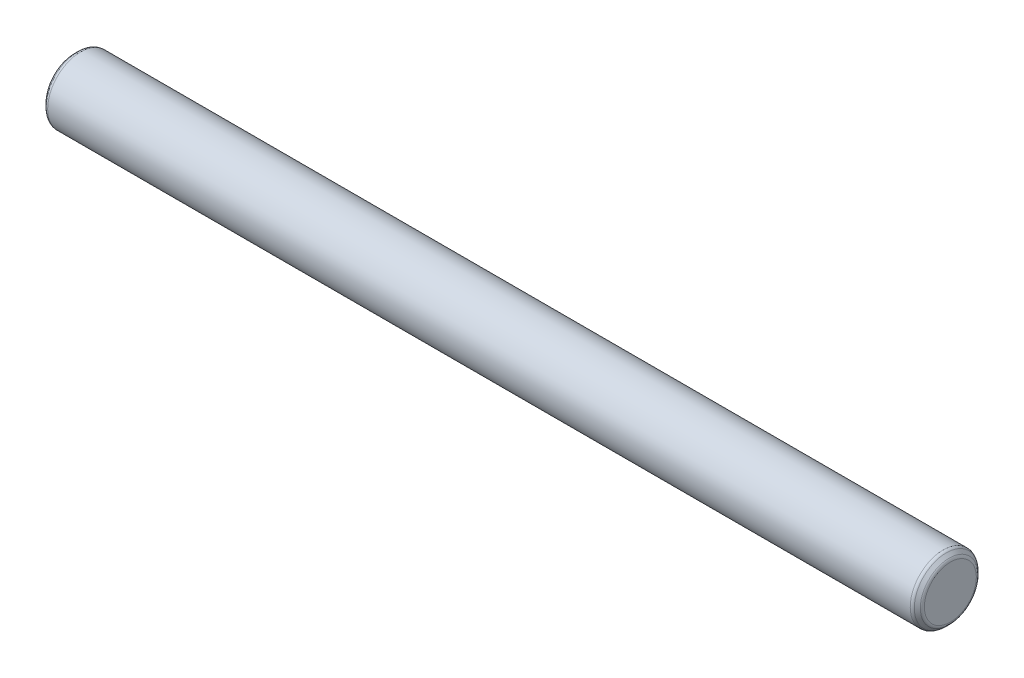
ISO-10303-21;
HEADER;
FILE_DESCRIPTION(('STEP AP214'),'2;1');
FILE_NAME('part.step','',(''),(''),'','','');
FILE_SCHEMA(('AUTOMOTIVE_DESIGN { 1 0 10303 214 1 1 1 1 }'));
ENDSEC;
DATA;
#1=APPLICATION_CONTEXT('core data for automotive mechanical design processes');
#2=APPLICATION_PROTOCOL_DEFINITION('international standard','automotive_design',2000,#1);
#3=PRODUCT_CONTEXT('',#1,'mechanical');
#4=PRODUCT('Part','Part','',(#3));
#5=PRODUCT_RELATED_PRODUCT_CATEGORY('part','',(#4));
#6=PRODUCT_DEFINITION_FORMATION('','',#4);
#7=PRODUCT_DEFINITION_CONTEXT('part definition',#1,'design');
#8=PRODUCT_DEFINITION('design','',#6,#7);
#9=PRODUCT_DEFINITION_SHAPE('','',#8);
#10=(LENGTH_UNIT() NAMED_UNIT(*) SI_UNIT(.MILLI.,.METRE.));
#11=(NAMED_UNIT(*) PLANE_ANGLE_UNIT() SI_UNIT($,.RADIAN.));
#12=(NAMED_UNIT(*) SI_UNIT($,.STERADIAN.) SOLID_ANGLE_UNIT());
#13=UNCERTAINTY_MEASURE_WITH_UNIT(LENGTH_MEASURE(1.E-05),#10,'distance_accuracy_value','');
#14=(GEOMETRIC_REPRESENTATION_CONTEXT(3) GLOBAL_UNCERTAINTY_ASSIGNED_CONTEXT((#13)) GLOBAL_UNIT_ASSIGNED_CONTEXT((#10,
#11,#12)) REPRESENTATION_CONTEXT('',''));
#15=CARTESIAN_POINT('',(0.,0.,0.));
#16=DIRECTION('',(0.,0.,1.));
#17=DIRECTION('',(1.,0.,0.));
#18=AXIS2_PLACEMENT_3D('',#15,#16,#17);
#19=CARTESIAN_POINT('',(82.55,0.,0.));
#20=DIRECTION('',(-1.,0.,0.));
#21=DIRECTION('',(0.,0.,1.));
#22=AXIS2_PLACEMENT_3D('',#19,#20,#21);
#23=CYLINDRICAL_SURFACE('',#22,3.1115);
#24=CARTESIAN_POINT('',(0.66581536726415,0.,0.));
#25=DIRECTION('',(-1.,0.,0.));
#26=DIRECTION('',(0.,0.,1.));
#27=AXIS2_PLACEMENT_3D('',#24,#25,#26);
#28=CIRCLE('',#27,3.1115);
#29=CARTESIAN_POINT('',(0.66581536726415,0.,3.1115));
#30=VERTEX_POINT('',#29);
#31=EDGE_CURVE('E49',#30,#30,#28,.F.);
#32=ORIENTED_EDGE('',*,*,#31,.T.);
#33=EDGE_LOOP('',(#32));
#34=FACE_BOUND('',#33,.T.);
#35=CARTESIAN_POINT('',(81.8841846327358,0.,0.));
#36=DIRECTION('',(1.,0.,0.));
#37=DIRECTION('',(0.,0.,-1.));
#38=AXIS2_PLACEMENT_3D('',#35,#36,#37);
#39=CIRCLE('',#38,3.1115);
#40=CARTESIAN_POINT('',(81.8841846327358,0.,-3.1115));
#41=VERTEX_POINT('',#40);
#42=EDGE_CURVE('E54',#41,#41,#39,.F.);
#43=ORIENTED_EDGE('',*,*,#42,.T.);
#44=EDGE_LOOP('',(#43));
#45=FACE_BOUND('',#44,.T.);
#46=ADVANCED_FACE('F34',(#34,#45),#23,.T.);
#47=CARTESIAN_POINT('',(82.55,0.,0.));
#48=DIRECTION('',(1.,0.,0.));
#49=DIRECTION('',(0.,0.,-1.));
#50=AXIS2_PLACEMENT_3D('',#47,#48,#49);
#51=PLANE('',#50);
#52=CARTESIAN_POINT('',(82.55,0.,0.));
#53=DIRECTION('',(1.,0.,0.));
#54=DIRECTION('',(0.,0.,-1.));
#55=AXIS2_PLACEMENT_3D('',#52,#53,#54);
#56=CIRCLE('',#55,2.44568463273584);
#57=CARTESIAN_POINT('',(82.55,0.,-2.44568463273584));
#58=VERTEX_POINT('',#57);
#59=EDGE_CURVE('E63',#58,#58,#56,.T.);
#60=ORIENTED_EDGE('',*,*,#59,.T.);
#61=EDGE_LOOP('',(#60));
#62=FACE_BOUND('',#61,.T.);
#63=ADVANCED_FACE('F67',(#62),#51,.T.);
#64=CARTESIAN_POINT('',(0.,0.,0.));
#65=DIRECTION('',(1.,0.,0.));
#66=DIRECTION('',(0.,0.,-1.));
#67=AXIS2_PLACEMENT_3D('',#64,#65,#66);
#68=PLANE('',#67);
#69=CARTESIAN_POINT('',(0.,0.,0.));
#70=DIRECTION('',(1.,0.,0.));
#71=DIRECTION('',(0.,0.,-1.));
#72=AXIS2_PLACEMENT_3D('',#69,#70,#71);
#73=CIRCLE('',#72,2.44568463273585);
#74=CARTESIAN_POINT('',(0.,0.,-2.44568463273585));
#75=VERTEX_POINT('',#74);
#76=EDGE_CURVE('E10',#75,#75,#73,.F.);
#77=ORIENTED_EDGE('',*,*,#76,.T.);
#78=EDGE_LOOP('',(#77));
#79=FACE_BOUND('',#78,.T.);
#80=ADVANCED_FACE('F91',(#79),#68,.F.);
#81=CARTESIAN_POINT('',(82.55,0.,0.));
#82=DIRECTION('',(-1.,0.,0.));
#83=DIRECTION('',(0.,0.,1.));
#84=AXIS2_PLACEMENT_3D('',#81,#82,#83);
#85=CONICAL_SURFACE('',#84,2.60349999999999,0.785398163397424);
#86=CARTESIAN_POINT('',(82.4384076836321,0.,0.));
#87=DIRECTION('',(1.,0.,0.));
#88=DIRECTION('',(0.,0.,-1.));
#89=AXIS2_PLACEMENT_3D('',#86,#87,#88);
#90=CIRCLE('',#89,2.71509231636792);
#91=CARTESIAN_POINT('',(82.4384076836321,0.,-2.71509231636792));
#92=VERTEX_POINT('',#91);
#93=EDGE_CURVE('E57',#92,#92,#90,.F.);
#94=ORIENTED_EDGE('',*,*,#93,.T.);
#95=EDGE_LOOP('',(#94));
#96=FACE_BOUND('',#95,.T.);
#97=CARTESIAN_POINT('',(82.1535923163679,0.,0.));
#98=DIRECTION('',(-1.,0.,0.));
#99=DIRECTION('',(0.,0.,1.));
#100=AXIS2_PLACEMENT_3D('',#97,#98,#99);
#101=CIRCLE('',#100,2.99990768363208);
#102=CARTESIAN_POINT('',(82.1535923163679,0.,2.99990768363208));
#103=VERTEX_POINT('',#102);
#104=EDGE_CURVE('E60',#103,#103,#101,.F.);
#105=ORIENTED_EDGE('',*,*,#104,.T.);
#106=EDGE_LOOP('',(#105));
#107=FACE_BOUND('',#106,.T.);
#108=ADVANCED_FACE('F82',(#96,#107),#85,.T.);
#109=CARTESIAN_POINT('',(0.508000000000008,0.,0.));
#110=DIRECTION('',(1.,0.,0.));
#111=DIRECTION('',(0.,0.,-1.));
#112=AXIS2_PLACEMENT_3D('',#109,#110,#111);
#113=CONICAL_SURFACE('',#112,3.1115,0.785398163397438);
#114=CARTESIAN_POINT('',(0.396407683632081,0.,0.));
#115=DIRECTION('',(1.,0.,0.));
#116=DIRECTION('',(0.,0.,-1.));
#117=AXIS2_PLACEMENT_3D('',#114,#115,#116);
#118=CIRCLE('',#117,2.99990768363207);
#119=CARTESIAN_POINT('',(0.396407683632081,0.,-2.99990768363207));
#120=VERTEX_POINT('',#119);
#121=EDGE_CURVE('E41',#120,#120,#118,.F.);
#122=ORIENTED_EDGE('',*,*,#121,.T.);
#123=EDGE_LOOP('',(#122));
#124=FACE_BOUND('',#123,.T.);
#125=CARTESIAN_POINT('',(0.111592316367928,0.,0.));
#126=DIRECTION('',(1.,0.,0.));
#127=DIRECTION('',(0.,0.,-1.));
#128=AXIS2_PLACEMENT_3D('',#125,#126,#127);
#129=CIRCLE('',#128,2.71509231636793);
#130=CARTESIAN_POINT('',(0.111592316367928,0.,-2.71509231636793));
#131=VERTEX_POINT('',#130);
#132=EDGE_CURVE('E45',#131,#131,#129,.T.);
#133=ORIENTED_EDGE('',*,*,#132,.T.);
#134=EDGE_LOOP('',(#133));
#135=FACE_BOUND('',#134,.T.);
#136=ADVANCED_FACE('F72',(#124,#135),#113,.T.);
#137=CARTESIAN_POINT('',(82.169,0.,0.));
#138=DIRECTION('',(1.,0.,0.));
#139=DIRECTION('',(0.,0.,-1.));
#140=AXIS2_PLACEMENT_3D('',#137,#138,#139);
#141=TOROIDAL_SURFACE('',#140,2.44568463273584,0.381);
#142=ORIENTED_EDGE('',*,*,#93,.F.);
#143=EDGE_LOOP('',(#142));
#144=FACE_BOUND('',#143,.T.);
#145=ORIENTED_EDGE('',*,*,#59,.F.);
#146=EDGE_LOOP('',(#145));
#147=FACE_BOUND('',#146,.T.);
#148=ADVANCED_FACE('F69',(#144,#147),#141,.T.);
#149=CARTESIAN_POINT('',(0.66581536726415,0.,0.));
#150=DIRECTION('',(-1.,0.,0.));
#151=DIRECTION('',(0.,0.,1.));
#152=AXIS2_PLACEMENT_3D('',#149,#150,#151);
#153=TOROIDAL_SURFACE('',#152,2.7305,0.381);
#154=ORIENTED_EDGE('',*,*,#121,.F.);
#155=EDGE_LOOP('',(#154));
#156=FACE_BOUND('',#155,.T.);
#157=ORIENTED_EDGE('',*,*,#31,.F.);
#158=EDGE_LOOP('',(#157));
#159=FACE_BOUND('',#158,.T.);
#160=ADVANCED_FACE('F71',(#156,#159),#153,.T.);
#161=CARTESIAN_POINT('',(0.381,0.,0.));
#162=DIRECTION('',(1.,0.,0.));
#163=DIRECTION('',(0.,0.,-1.));
#164=AXIS2_PLACEMENT_3D('',#161,#162,#163);
#165=TOROIDAL_SURFACE('',#164,2.44568463273585,0.381);
#166=ORIENTED_EDGE('',*,*,#132,.F.);
#167=EDGE_LOOP('',(#166));
#168=FACE_BOUND('',#167,.T.);
#169=ORIENTED_EDGE('',*,*,#76,.F.);
#170=EDGE_LOOP('',(#169));
#171=FACE_BOUND('',#170,.T.);
#172=ADVANCED_FACE('F79',(#168,#171),#165,.T.);
#173=CARTESIAN_POINT('',(81.8841846327358,0.,0.));
#174=DIRECTION('',(1.,0.,0.));
#175=DIRECTION('',(0.,0.,-1.));
#176=AXIS2_PLACEMENT_3D('',#173,#174,#175);
#177=TOROIDAL_SURFACE('',#176,2.7305,0.381);
#178=ORIENTED_EDGE('',*,*,#104,.F.);
#179=EDGE_LOOP('',(#178));
#180=FACE_BOUND('',#179,.T.);
#181=ORIENTED_EDGE('',*,*,#42,.F.);
#182=EDGE_LOOP('',(#181));
#183=FACE_BOUND('',#182,.T.);
#184=ADVANCED_FACE('F36',(#180,#183),#177,.T.);
#185=CLOSED_SHELL('',(#46,#63,#80,#108,#136,#148,#160,#172,#184));
#186=MANIFOLD_SOLID_BREP('B2',#185);
#187=ADVANCED_BREP_SHAPE_REPRESENTATION('',(#18,#186),#14);
#188=SHAPE_DEFINITION_REPRESENTATION(#9,#187);
ENDSEC;
END-ISO-10303-21;
